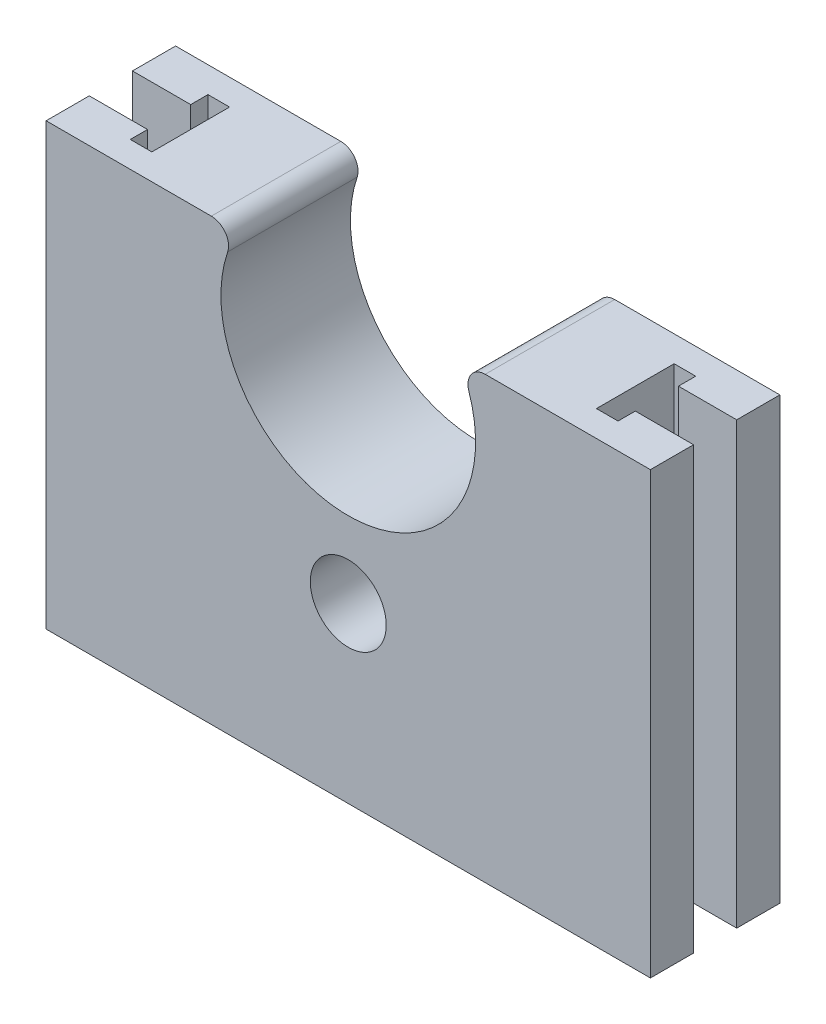
ISO-10303-21;
HEADER;
FILE_DESCRIPTION(('STEP AP214'),'2;1');
FILE_NAME('part.step','',(''),(''),'','','');
FILE_SCHEMA(('AUTOMOTIVE_DESIGN { 1 0 10303 214 1 1 1 1 }'));
ENDSEC;
DATA;
#1=APPLICATION_CONTEXT('core data for automotive mechanical design processes');
#2=APPLICATION_PROTOCOL_DEFINITION('international standard','automotive_design',2000,#1);
#3=PRODUCT_CONTEXT('',#1,'mechanical');
#4=PRODUCT('Part','Part','',(#3));
#5=PRODUCT_RELATED_PRODUCT_CATEGORY('part','',(#4));
#6=PRODUCT_DEFINITION_FORMATION('','',#4);
#7=PRODUCT_DEFINITION_CONTEXT('part definition',#1,'design');
#8=PRODUCT_DEFINITION('design','',#6,#7);
#9=PRODUCT_DEFINITION_SHAPE('','',#8);
#10=(LENGTH_UNIT() NAMED_UNIT(*) SI_UNIT(.MILLI.,.METRE.));
#11=(NAMED_UNIT(*) PLANE_ANGLE_UNIT() SI_UNIT($,.RADIAN.));
#12=(NAMED_UNIT(*) SI_UNIT($,.STERADIAN.) SOLID_ANGLE_UNIT());
#13=UNCERTAINTY_MEASURE_WITH_UNIT(LENGTH_MEASURE(1.E-05),#10,'distance_accuracy_value','');
#14=(GEOMETRIC_REPRESENTATION_CONTEXT(3) GLOBAL_UNCERTAINTY_ASSIGNED_CONTEXT((#13)) GLOBAL_UNIT_ASSIGNED_CONTEXT((#10,
#11,#12)) REPRESENTATION_CONTEXT('',''));
#15=CARTESIAN_POINT('',(0.,0.,0.));
#16=DIRECTION('',(0.,0.,1.));
#17=DIRECTION('',(1.,0.,0.));
#18=AXIS2_PLACEMENT_3D('',#15,#16,#17);
#19=CARTESIAN_POINT('',(42.4004975124378,28.0149253731343,15.));
#20=DIRECTION('',(-1.,0.,0.));
#21=DIRECTION('',(0.,0.,1.));
#22=AXIS2_PLACEMENT_3D('',#19,#20,#21);
#23=PLANE('',#22);
#24=DIRECTION('',(0.,1.,0.));
#25=VECTOR('',#24,1.);
#26=CARTESIAN_POINT('',(42.4004975124378,-22.9850746268657,10.));
#27=LINE('',#26,#25);
#28=CARTESIAN_POINT('',(42.4004975124378,-22.9850746268657,10.));
#29=VERTEX_POINT('',#28);
#30=CARTESIAN_POINT('',(42.4004975124378,28.0149253731343,10.));
#31=VERTEX_POINT('',#30);
#32=EDGE_CURVE('E241',#29,#31,#27,.T.);
#33=ORIENTED_EDGE('',*,*,#32,.T.);
#34=DIRECTION('',(0.,0.,-1.));
#35=VECTOR('',#34,1.);
#36=CARTESIAN_POINT('',(42.4004975124378,28.0149253731343,15.));
#37=LINE('',#36,#35);
#38=CARTESIAN_POINT('',(42.4004975124378,28.0149253731343,15.));
#39=VERTEX_POINT('',#38);
#40=EDGE_CURVE('E451',#39,#31,#37,.T.);
#41=ORIENTED_EDGE('',*,*,#40,.F.);
#42=DIRECTION('',(0.,1.,0.));
#43=VECTOR('',#42,1.);
#44=CARTESIAN_POINT('',(42.4004975124378,28.0149253731343,15.));
#45=LINE('',#44,#43);
#46=CARTESIAN_POINT('',(42.4004975124378,-22.9850746268657,15.));
#47=VERTEX_POINT('',#46);
#48=EDGE_CURVE('E368',#47,#39,#45,.T.);
#49=ORIENTED_EDGE('',*,*,#48,.F.);
#50=DIRECTION('',(0.,0.,-1.));
#51=VECTOR('',#50,1.);
#52=CARTESIAN_POINT('',(42.4004975124378,-22.9850746268657,15.));
#53=LINE('',#52,#51);
#54=EDGE_CURVE('E421',#47,#29,#53,.T.);
#55=ORIENTED_EDGE('',*,*,#54,.T.);
#56=EDGE_LOOP('',(#33,#41,#49,#55));
#57=FACE_BOUND('',#56,.T.);
#58=ADVANCED_FACE('F67',(#57),#23,.F.);
#59=CARTESIAN_POINT('',(42.4004975124378,28.0149253731343,15.));
#60=DIRECTION('',(0.,-1.,0.));
#61=DIRECTION('',(0.,0.,-1.));
#62=AXIS2_PLACEMENT_3D('',#59,#60,#61);
#63=PLANE('',#62);
#64=DIRECTION('',(-1.,0.,0.));
#65=VECTOR('',#64,1.);
#66=CARTESIAN_POINT('',(0.,28.0149253731343,10.));
#67=LINE('',#66,#65);
#68=CARTESIAN_POINT('',(35.6504975124378,28.0149253731343,10.));
#69=VERTEX_POINT('',#68);
#70=EDGE_CURVE('E294',#31,#69,#67,.T.);
#71=ORIENTED_EDGE('',*,*,#70,.T.);
#72=DIRECTION('',(0.,0.,-1.));
#73=VECTOR('',#72,1.);
#74=CARTESIAN_POINT('',(35.6504975124378,28.0149253731343,12.));
#75=LINE('',#74,#73);
#76=CARTESIAN_POINT('',(35.6504975124378,28.0149253731343,12.));
#77=VERTEX_POINT('',#76);
#78=EDGE_CURVE('E237',#77,#69,#75,.T.);
#79=ORIENTED_EDGE('',*,*,#78,.F.);
#80=DIRECTION('',(-1.,0.,0.));
#81=VECTOR('',#80,1.);
#82=CARTESIAN_POINT('',(35.6504975124378,28.0149253731343,12.));
#83=LINE('',#82,#81);
#84=CARTESIAN_POINT('',(33.1504975124378,28.0149253731343,12.));
#85=VERTEX_POINT('',#84);
#86=EDGE_CURVE('E269',#77,#85,#83,.T.);
#87=ORIENTED_EDGE('',*,*,#86,.T.);
#88=DIRECTION('',(0.,0.,-1.));
#89=VECTOR('',#88,1.);
#90=CARTESIAN_POINT('',(33.1504975124378,28.0149253731343,12.));
#91=LINE('',#90,#89);
#92=CARTESIAN_POINT('',(33.1504975124378,28.0149253731343,2.99999999999998));
#93=VERTEX_POINT('',#92);
#94=EDGE_CURVE('E273',#85,#93,#91,.T.);
#95=ORIENTED_EDGE('',*,*,#94,.T.);
#96=DIRECTION('',(-1.,0.,0.));
#97=VECTOR('',#96,1.);
#98=CARTESIAN_POINT('',(35.6504975124378,28.0149253731343,2.99999999999998));
#99=LINE('',#98,#97);
#100=CARTESIAN_POINT('',(35.6504975124378,28.0149253731343,2.99999999999998));
#101=VERTEX_POINT('',#100);
#102=EDGE_CURVE('E278',#101,#93,#99,.T.);
#103=ORIENTED_EDGE('',*,*,#102,.F.);
#104=CARTESIAN_POINT('',(35.6504975124378,28.0149253731343,5.));
#105=VERTEX_POINT('',#104);
#106=EDGE_CURVE('E282',#105,#101,#75,.T.);
#107=ORIENTED_EDGE('',*,*,#106,.F.);
#108=DIRECTION('',(-1.,0.,0.));
#109=VECTOR('',#108,1.);
#110=CARTESIAN_POINT('',(0.,28.0149253731343,5.));
#111=LINE('',#110,#109);
#112=CARTESIAN_POINT('',(42.4004975124378,28.0149253731343,5.));
#113=VERTEX_POINT('',#112);
#114=EDGE_CURVE('E252',#113,#105,#111,.T.);
#115=ORIENTED_EDGE('',*,*,#114,.F.);
#116=CARTESIAN_POINT('',(42.4004975124378,28.0149253731343,0.));
#117=VERTEX_POINT('',#116);
#118=EDGE_CURVE('E450',#113,#117,#37,.T.);
#119=ORIENTED_EDGE('',*,*,#118,.T.);
#120=DIRECTION('',(-1.,0.,0.));
#121=VECTOR('',#120,1.);
#122=CARTESIAN_POINT('',(42.4004975124378,28.0149253731343,0.));
#123=LINE('',#122,#121);
#124=CARTESIAN_POINT('',(23.2646670463277,28.0149253731343,0.));
#125=VERTEX_POINT('',#124);
#126=EDGE_CURVE('E398',#117,#125,#123,.T.);
#127=ORIENTED_EDGE('',*,*,#126,.T.);
#128=DIRECTION('',(0.,0.,-1.));
#129=VECTOR('',#128,1.);
#130=CARTESIAN_POINT('',(23.2646670463277,28.0149253731343,15.));
#131=LINE('',#130,#129);
#132=CARTESIAN_POINT('',(23.2646670463277,28.0149253731343,15.));
#133=VERTEX_POINT('',#132);
#134=EDGE_CURVE('E446',#133,#125,#131,.T.);
#135=ORIENTED_EDGE('',*,*,#134,.F.);
#136=DIRECTION('',(-1.,0.,0.));
#137=VECTOR('',#136,1.);
#138=CARTESIAN_POINT('',(42.4004975124378,28.0149253731343,15.));
#139=LINE('',#138,#137);
#140=EDGE_CURVE('E372',#39,#133,#139,.T.);
#141=ORIENTED_EDGE('',*,*,#140,.F.);
#142=ORIENTED_EDGE('',*,*,#40,.T.);
#143=EDGE_LOOP('',(#71,#79,#87,#95,#103,#107,#115,#119,#127,#135,#141,#142));
#144=FACE_BOUND('',#143,.T.);
#145=ADVANCED_FACE('F509',(#144),#63,.F.);
#146=CARTESIAN_POINT('',(-8.46367202145209,28.0149253731343,15.));
#147=DIRECTION('',(0.,-1.,0.));
#148=DIRECTION('',(1.,0.,0.));
#149=AXIS2_PLACEMENT_3D('',#146,#147,#148);
#150=PLANE('',#149);
#151=DIRECTION('',(1.,0.,0.));
#152=VECTOR('',#151,1.);
#153=CARTESIAN_POINT('',(0.,28.0149253731343,5.));
#154=LINE('',#153,#152);
#155=CARTESIAN_POINT('',(-27.5995024875622,28.0149253731343,5.));
#156=VERTEX_POINT('',#155);
#157=CARTESIAN_POINT('',(-20.8495024875622,28.0149253731343,5.));
#158=VERTEX_POINT('',#157);
#159=EDGE_CURVE('E342',#156,#158,#154,.T.);
#160=ORIENTED_EDGE('',*,*,#159,.T.);
#161=DIRECTION('',(0.,0.,-1.));
#162=VECTOR('',#161,1.);
#163=CARTESIAN_POINT('',(-20.8495024875622,28.0149253731343,11.9999586403807));
#164=LINE('',#163,#162);
#165=CARTESIAN_POINT('',(-20.8495024875622,28.0149253731343,2.99995864038069));
#166=VERTEX_POINT('',#165);
#167=EDGE_CURVE('E313',#158,#166,#164,.T.);
#168=ORIENTED_EDGE('',*,*,#167,.T.);
#169=DIRECTION('',(1.,0.,0.));
#170=VECTOR('',#169,1.);
#171=CARTESIAN_POINT('',(-20.8495024875622,28.0149253731343,2.99995864038069));
#172=LINE('',#171,#170);
#173=CARTESIAN_POINT('',(-18.3495024875622,28.0149253731343,2.99995864038069));
#174=VERTEX_POINT('',#173);
#175=EDGE_CURVE('E314',#166,#174,#172,.T.);
#176=ORIENTED_EDGE('',*,*,#175,.T.);
#177=DIRECTION('',(0.,0.,-1.));
#178=VECTOR('',#177,1.);
#179=CARTESIAN_POINT('',(-18.3495024875622,28.0149253731343,11.9999586403807));
#180=LINE('',#179,#178);
#181=CARTESIAN_POINT('',(-18.3495024875622,28.0149253731343,11.9999586403807));
#182=VERTEX_POINT('',#181);
#183=EDGE_CURVE('E318',#182,#174,#180,.T.);
#184=ORIENTED_EDGE('',*,*,#183,.F.);
#185=DIRECTION('',(1.,0.,0.));
#186=VECTOR('',#185,1.);
#187=CARTESIAN_POINT('',(-20.8495024875622,28.0149253731343,11.9999586403807));
#188=LINE('',#187,#186);
#189=CARTESIAN_POINT('',(-20.8495024875622,28.0149253731343,11.9999586403807));
#190=VERTEX_POINT('',#189);
#191=EDGE_CURVE('E274',#190,#182,#188,.T.);
#192=ORIENTED_EDGE('',*,*,#191,.F.);
#193=CARTESIAN_POINT('',(-20.8495024875622,28.0149253731343,10.));
#194=VERTEX_POINT('',#193);
#195=EDGE_CURVE('E309',#190,#194,#164,.T.);
#196=ORIENTED_EDGE('',*,*,#195,.T.);
#197=DIRECTION('',(1.,0.,0.));
#198=VECTOR('',#197,1.);
#199=CARTESIAN_POINT('',(0.,28.0149253731343,10.));
#200=LINE('',#199,#198);
#201=CARTESIAN_POINT('',(-27.5995024875622,28.0149253731343,10.));
#202=VERTEX_POINT('',#201);
#203=EDGE_CURVE('E308',#202,#194,#200,.T.);
#204=ORIENTED_EDGE('',*,*,#203,.F.);
#205=DIRECTION('',(0.,0.,-1.));
#206=VECTOR('',#205,1.);
#207=CARTESIAN_POINT('',(-27.5995024875622,28.0149253731343,15.));
#208=LINE('',#207,#206);
#209=CARTESIAN_POINT('',(-27.5995024875622,28.0149253731343,15.));
#210=VERTEX_POINT('',#209);
#211=EDGE_CURVE('E430',#210,#202,#208,.T.);
#212=ORIENTED_EDGE('',*,*,#211,.F.);
#213=DIRECTION('',(-1.,0.,0.));
#214=VECTOR('',#213,1.);
#215=CARTESIAN_POINT('',(-8.46367202145209,28.0149253731343,15.));
#216=LINE('',#215,#214);
#217=CARTESIAN_POINT('',(-8.46367202145209,28.0149253731343,15.));
#218=VERTEX_POINT('',#217);
#219=EDGE_CURVE('E385',#218,#210,#216,.T.);
#220=ORIENTED_EDGE('',*,*,#219,.F.);
#221=DIRECTION('',(0.,0.,-1.));
#222=VECTOR('',#221,1.);
#223=CARTESIAN_POINT('',(-8.46367202145209,28.0149253731343,15.));
#224=LINE('',#223,#222);
#225=CARTESIAN_POINT('',(-8.46367202145209,28.0149253731343,0.));
#226=VERTEX_POINT('',#225);
#227=EDGE_CURVE('E434',#218,#226,#224,.T.);
#228=ORIENTED_EDGE('',*,*,#227,.T.);
#229=DIRECTION('',(-1.,0.,0.));
#230=VECTOR('',#229,1.);
#231=CARTESIAN_POINT('',(-8.46367202145209,28.0149253731343,0.));
#232=LINE('',#231,#230);
#233=CARTESIAN_POINT('',(-27.5995024875622,28.0149253731343,0.));
#234=VERTEX_POINT('',#233);
#235=EDGE_CURVE('E410',#226,#234,#232,.T.);
#236=ORIENTED_EDGE('',*,*,#235,.T.);
#237=EDGE_CURVE('E429',#156,#234,#208,.T.);
#238=ORIENTED_EDGE('',*,*,#237,.F.);
#239=EDGE_LOOP('',(#160,#168,#176,#184,#192,#196,#204,#212,#220,#228,#236,#238));
#240=FACE_BOUND('',#239,.T.);
#241=ADVANCED_FACE('F468',(#240),#150,.F.);
#242=CARTESIAN_POINT('',(-27.5995024875622,28.0149253731343,15.));
#243=DIRECTION('',(1.,0.,0.));
#244=DIRECTION('',(0.,0.,-1.));
#245=AXIS2_PLACEMENT_3D('',#242,#243,#244);
#246=PLANE('',#245);
#247=DIRECTION('',(0.,-1.,0.));
#248=VECTOR('',#247,1.);
#249=CARTESIAN_POINT('',(-27.5995024875622,28.0149253731343,5.));
#250=LINE('',#249,#248);
#251=CARTESIAN_POINT('',(-27.5995024875622,-22.9850746268657,5.));
#252=VERTEX_POINT('',#251);
#253=EDGE_CURVE('E351',#156,#252,#250,.T.);
#254=ORIENTED_EDGE('',*,*,#253,.F.);
#255=ORIENTED_EDGE('',*,*,#237,.T.);
#256=DIRECTION('',(0.,-1.,0.));
#257=VECTOR('',#256,1.);
#258=CARTESIAN_POINT('',(-27.5995024875622,28.0149253731343,0.));
#259=LINE('',#258,#257);
#260=CARTESIAN_POINT('',(-27.5995024875622,-22.9850746268657,0.));
#261=VERTEX_POINT('',#260);
#262=EDGE_CURVE('E414',#234,#261,#259,.T.);
#263=ORIENTED_EDGE('',*,*,#262,.T.);
#264=DIRECTION('',(0.,0.,-1.));
#265=VECTOR('',#264,1.);
#266=CARTESIAN_POINT('',(-27.5995024875622,-22.9850746268657,15.));
#267=LINE('',#266,#265);
#268=EDGE_CURVE('E424',#252,#261,#267,.T.);
#269=ORIENTED_EDGE('',*,*,#268,.F.);
#270=EDGE_LOOP('',(#254,#255,#263,#269));
#271=FACE_BOUND('',#270,.T.);
#272=ADVANCED_FACE('F552',(#271),#246,.F.);
#273=CARTESIAN_POINT('',(42.4004975124378,-22.9850746268657,15.));
#274=DIRECTION('',(0.,1.,0.));
#275=DIRECTION('',(0.,0.,1.));
#276=AXIS2_PLACEMENT_3D('',#273,#274,#275);
#277=PLANE('',#276);
#278=DIRECTION('',(-1.,0.,0.));
#279=VECTOR('',#278,1.);
#280=CARTESIAN_POINT('',(0.,-22.9850746268657,10.));
#281=LINE('',#280,#279);
#282=CARTESIAN_POINT('',(35.6504975124378,-22.9850746268657,10.));
#283=VERTEX_POINT('',#282);
#284=EDGE_CURVE('E245',#29,#283,#281,.T.);
#285=ORIENTED_EDGE('',*,*,#284,.F.);
#286=ORIENTED_EDGE('',*,*,#54,.F.);
#287=DIRECTION('',(1.,0.,0.));
#288=VECTOR('',#287,1.);
#289=CARTESIAN_POINT('',(42.4004975124378,-22.9850746268657,15.));
#290=LINE('',#289,#288);
#291=CARTESIAN_POINT('',(-27.5995024875622,-22.9850746268657,15.));
#292=VERTEX_POINT('',#291);
#293=EDGE_CURVE('E391',#292,#47,#290,.T.);
#294=ORIENTED_EDGE('',*,*,#293,.F.);
#295=CARTESIAN_POINT('',(-27.5995024875622,-22.9850746268657,10.));
#296=VERTEX_POINT('',#295);
#297=EDGE_CURVE('E425',#292,#296,#267,.T.);
#298=ORIENTED_EDGE('',*,*,#297,.T.);
#299=DIRECTION('',(1.,0.,0.));
#300=VECTOR('',#299,1.);
#301=CARTESIAN_POINT('',(42.4004975124378,-22.9850746268657,10.));
#302=LINE('',#301,#300);
#303=CARTESIAN_POINT('',(-20.8495024875622,-22.9850746268657,10.));
#304=VERTEX_POINT('',#303);
#305=EDGE_CURVE('E76',#296,#304,#302,.T.);
#306=ORIENTED_EDGE('',*,*,#305,.T.);
#307=DIRECTION('',(0.,0.,-1.));
#308=VECTOR('',#307,1.);
#309=CARTESIAN_POINT('',(-20.8495024875622,-22.9850746268657,11.9999586403807));
#310=LINE('',#309,#308);
#311=CARTESIAN_POINT('',(-20.8495024875622,-22.9850746268657,11.9999586403807));
#312=VERTEX_POINT('',#311);
#313=EDGE_CURVE('E298',#312,#304,#310,.T.);
#314=ORIENTED_EDGE('',*,*,#313,.F.);
#315=DIRECTION('',(1.,0.,0.));
#316=VECTOR('',#315,1.);
#317=CARTESIAN_POINT('',(-20.8495024875622,-22.9850746268657,11.9999586403807));
#318=LINE('',#317,#316);
#319=CARTESIAN_POINT('',(-18.3495024875622,-22.9850746268657,11.9999586403807));
#320=VERTEX_POINT('',#319);
#321=EDGE_CURVE('E91',#312,#320,#318,.T.);
#322=ORIENTED_EDGE('',*,*,#321,.T.);
#323=DIRECTION('',(0.,0.,-1.));
#324=VECTOR('',#323,1.);
#325=CARTESIAN_POINT('',(-18.3495024875622,-22.9850746268657,11.9999586403807));
#326=LINE('',#325,#324);
#327=CARTESIAN_POINT('',(-18.3495024875622,-22.9850746268657,2.99995864038069));
#328=VERTEX_POINT('',#327);
#329=EDGE_CURVE('E332',#320,#328,#326,.T.);
#330=ORIENTED_EDGE('',*,*,#329,.T.);
#331=DIRECTION('',(1.,0.,0.));
#332=VECTOR('',#331,1.);
#333=CARTESIAN_POINT('',(-20.8495024875622,-22.9850746268657,2.99995864038069));
#334=LINE('',#333,#332);
#335=CARTESIAN_POINT('',(-20.8495024875622,-22.9850746268657,2.99995864038069));
#336=VERTEX_POINT('',#335);
#337=EDGE_CURVE('E329',#336,#328,#334,.T.);
#338=ORIENTED_EDGE('',*,*,#337,.F.);
#339=CARTESIAN_POINT('',(-20.8495024875622,-22.9850746268657,5.));
#340=VERTEX_POINT('',#339);
#341=EDGE_CURVE('E328',#340,#336,#310,.T.);
#342=ORIENTED_EDGE('',*,*,#341,.F.);
#343=DIRECTION('',(1.,0.,0.));
#344=VECTOR('',#343,1.);
#345=CARTESIAN_POINT('',(42.4004975124378,-22.9850746268657,5.00000000000001));
#346=LINE('',#345,#344);
#347=EDGE_CURVE('E12',#252,#340,#346,.T.);
#348=ORIENTED_EDGE('',*,*,#347,.F.);
#349=ORIENTED_EDGE('',*,*,#268,.T.);
#350=DIRECTION('',(1.,0.,0.));
#351=VECTOR('',#350,1.);
#352=CARTESIAN_POINT('',(42.4004975124378,-22.9850746268657,0.));
#353=LINE('',#352,#351);
#354=CARTESIAN_POINT('',(42.4004975124378,-22.9850746268657,0.));
#355=VERTEX_POINT('',#354);
#356=EDGE_CURVE('E373',#261,#355,#353,.T.);
#357=ORIENTED_EDGE('',*,*,#356,.T.);
#358=CARTESIAN_POINT('',(42.4004975124378,-22.9850746268657,5.));
#359=VERTEX_POINT('',#358);
#360=EDGE_CURVE('E394',#359,#355,#53,.T.);
#361=ORIENTED_EDGE('',*,*,#360,.F.);
#362=DIRECTION('',(-1.,0.,0.));
#363=VECTOR('',#362,1.);
#364=CARTESIAN_POINT('',(0.,-22.9850746268657,5.));
#365=LINE('',#364,#363);
#366=CARTESIAN_POINT('',(35.6504975124378,-22.9850746268657,5.));
#367=VERTEX_POINT('',#366);
#368=EDGE_CURVE('E242',#359,#367,#365,.T.);
#369=ORIENTED_EDGE('',*,*,#368,.T.);
#370=DIRECTION('',(0.,0.,-1.));
#371=VECTOR('',#370,1.);
#372=CARTESIAN_POINT('',(35.6504975124378,-22.9850746268657,12.));
#373=LINE('',#372,#371);
#374=CARTESIAN_POINT('',(35.6504975124378,-22.9850746268657,2.99999999999998));
#375=VERTEX_POINT('',#374);
#376=EDGE_CURVE('E259',#367,#375,#373,.T.);
#377=ORIENTED_EDGE('',*,*,#376,.T.);
#378=DIRECTION('',(-1.,0.,0.));
#379=VECTOR('',#378,1.);
#380=CARTESIAN_POINT('',(35.6504975124378,-22.9850746268657,2.99999999999998));
#381=LINE('',#380,#379);
#382=CARTESIAN_POINT('',(33.1504975124378,-22.9850746268657,2.99999999999998));
#383=VERTEX_POINT('',#382);
#384=EDGE_CURVE('E83',#375,#383,#381,.T.);
#385=ORIENTED_EDGE('',*,*,#384,.T.);
#386=DIRECTION('',(0.,0.,-1.));
#387=VECTOR('',#386,1.);
#388=CARTESIAN_POINT('',(33.1504975124378,-22.9850746268657,12.));
#389=LINE('',#388,#387);
#390=CARTESIAN_POINT('',(33.1504975124378,-22.9850746268657,12.));
#391=VERTEX_POINT('',#390);
#392=EDGE_CURVE('E496',#391,#383,#389,.T.);
#393=ORIENTED_EDGE('',*,*,#392,.F.);
#394=DIRECTION('',(-1.,0.,0.));
#395=VECTOR('',#394,1.);
#396=CARTESIAN_POINT('',(35.6504975124378,-22.9850746268657,12.));
#397=LINE('',#396,#395);
#398=CARTESIAN_POINT('',(35.6504975124378,-22.9850746268657,12.));
#399=VERTEX_POINT('',#398);
#400=EDGE_CURVE('E256',#399,#391,#397,.T.);
#401=ORIENTED_EDGE('',*,*,#400,.F.);
#402=EDGE_CURVE('E234',#399,#283,#373,.T.);
#403=ORIENTED_EDGE('',*,*,#402,.T.);
#404=EDGE_LOOP('',(#285,#286,#294,#298,#306,#314,#322,#330,#338,#342,#348,#349,#357,#361,#369,
#377,#385,#393,#401,#403));
#405=FACE_BOUND('',#404,.T.);
#406=ADVANCED_FACE('F254',(#405),#277,.F.);
#407=ORIENTED_EDGE('',*,*,#118,.F.);
#408=DIRECTION('',(0.,1.,0.));
#409=VECTOR('',#408,1.);
#410=CARTESIAN_POINT('',(42.4004975124378,-22.9850746268657,5.));
#411=LINE('',#410,#409);
#412=EDGE_CURVE('E526',#359,#113,#411,.T.);
#413=ORIENTED_EDGE('',*,*,#412,.F.);
#414=ORIENTED_EDGE('',*,*,#360,.T.);
#415=DIRECTION('',(0.,1.,0.));
#416=VECTOR('',#415,1.);
#417=CARTESIAN_POINT('',(42.4004975124378,28.0149253731343,0.));
#418=LINE('',#417,#416);
#419=EDGE_CURVE('E364',#355,#117,#418,.T.);
#420=ORIENTED_EDGE('',*,*,#419,.T.);
#421=EDGE_LOOP('',(#407,#413,#414,#420));
#422=FACE_BOUND('',#421,.T.);
#423=ADVANCED_FACE('F69',(#422),#23,.F.);
#424=CARTESIAN_POINT('',(23.2646670463277,26.0149253731343,15.));
#425=DIRECTION('',(0.,0.,-1.));
#426=DIRECTION('',(-1.,0.,0.));
#427=AXIS2_PLACEMENT_3D('',#424,#425,#426);
#428=CYLINDRICAL_SURFACE('',#427,2.);
#429=CARTESIAN_POINT('',(23.2646670463277,26.0149253731343,0.));
#430=DIRECTION('',(0.,0.,1.));
#431=DIRECTION('',(1.,0.,0.));
#432=AXIS2_PLACEMENT_3D('',#429,#430,#431);
#433=CIRCLE('',#432,2.);
#434=CARTESIAN_POINT('',(21.3704378482513,25.3731343283582,0.));
#435=VERTEX_POINT('',#434);
#436=EDGE_CURVE('E401',#125,#435,#433,.T.);
#437=ORIENTED_EDGE('',*,*,#436,.T.);
#438=DIRECTION('',(0.,0.,-1.));
#439=VECTOR('',#438,1.);
#440=CARTESIAN_POINT('',(21.3704378482513,25.3731343283582,15.));
#441=LINE('',#440,#439);
#442=CARTESIAN_POINT('',(21.3704378482513,25.3731343283582,15.));
#443=VERTEX_POINT('',#442);
#444=EDGE_CURVE('E442',#443,#435,#441,.T.);
#445=ORIENTED_EDGE('',*,*,#444,.F.);
#446=CARTESIAN_POINT('',(23.2646670463277,26.0149253731343,15.));
#447=DIRECTION('',(0.,0.,1.));
#448=DIRECTION('',(1.,0.,0.));
#449=AXIS2_PLACEMENT_3D('',#446,#447,#448);
#450=CIRCLE('',#449,2.);
#451=EDGE_CURVE('E376',#133,#443,#450,.T.);
#452=ORIENTED_EDGE('',*,*,#451,.F.);
#453=ORIENTED_EDGE('',*,*,#134,.T.);
#454=EDGE_LOOP('',(#437,#445,#452,#453));
#455=FACE_BOUND('',#454,.T.);
#456=ADVANCED_FACE('F564',(#455),#428,.T.);
#457=CARTESIAN_POINT('',(7.40049751243779,20.6399253731343,15.));
#458=DIRECTION('',(0.,0.,-1.));
#459=DIRECTION('',(-1.,0.,0.));
#460=AXIS2_PLACEMENT_3D('',#457,#458,#459);
#461=CYLINDRICAL_SURFACE('',#460,14.75);
#462=CARTESIAN_POINT('',(7.40049751243779,20.6399253731343,0.));
#463=DIRECTION('',(0.,0.,-1.));
#464=DIRECTION('',(1.,0.,0.));
#465=AXIS2_PLACEMENT_3D('',#462,#463,#464);
#466=CIRCLE('',#465,14.75);
#467=CARTESIAN_POINT('',(-6.56944282337568,25.3731343283582,0.));
#468=VERTEX_POINT('',#467);
#469=EDGE_CURVE('E404',#435,#468,#466,.T.);
#470=ORIENTED_EDGE('',*,*,#469,.T.);
#471=DIRECTION('',(0.,0.,-1.));
#472=VECTOR('',#471,1.);
#473=CARTESIAN_POINT('',(-6.56944282337568,25.3731343283582,15.));
#474=LINE('',#473,#472);
#475=CARTESIAN_POINT('',(-6.56944282337568,25.3731343283582,15.));
#476=VERTEX_POINT('',#475);
#477=EDGE_CURVE('E438',#476,#468,#474,.T.);
#478=ORIENTED_EDGE('',*,*,#477,.F.);
#479=CARTESIAN_POINT('',(7.40049751243779,20.6399253731343,15.));
#480=DIRECTION('',(0.,0.,-1.));
#481=DIRECTION('',(1.,0.,0.));
#482=AXIS2_PLACEMENT_3D('',#479,#480,#481);
#483=CIRCLE('',#482,14.75);
#484=EDGE_CURVE('E379',#443,#476,#483,.T.);
#485=ORIENTED_EDGE('',*,*,#484,.F.);
#486=ORIENTED_EDGE('',*,*,#444,.T.);
#487=EDGE_LOOP('',(#470,#478,#485,#486));
#488=FACE_BOUND('',#487,.T.);
#489=ADVANCED_FACE('F567',(#488),#461,.F.);
#490=CARTESIAN_POINT('',(-8.46367202145209,26.0149253731343,15.));
#491=DIRECTION('',(0.,0.,-1.));
#492=DIRECTION('',(-1.,0.,0.));
#493=AXIS2_PLACEMENT_3D('',#490,#491,#492);
#494=CYLINDRICAL_SURFACE('',#493,2.);
#495=CARTESIAN_POINT('',(-8.46367202145209,26.0149253731343,0.));
#496=DIRECTION('',(0.,0.,1.));
#497=DIRECTION('',(-1.,0.,0.));
#498=AXIS2_PLACEMENT_3D('',#495,#496,#497);
#499=CIRCLE('',#498,2.);
#500=EDGE_CURVE('E407',#468,#226,#499,.T.);
#501=ORIENTED_EDGE('',*,*,#500,.T.);
#502=ORIENTED_EDGE('',*,*,#227,.F.);
#503=CARTESIAN_POINT('',(-8.46367202145209,26.0149253731343,15.));
#504=DIRECTION('',(0.,0.,1.));
#505=DIRECTION('',(-1.,0.,0.));
#506=AXIS2_PLACEMENT_3D('',#503,#504,#505);
#507=CIRCLE('',#506,2.);
#508=EDGE_CURVE('E382',#476,#218,#507,.T.);
#509=ORIENTED_EDGE('',*,*,#508,.F.);
#510=ORIENTED_EDGE('',*,*,#477,.T.);
#511=EDGE_LOOP('',(#501,#502,#509,#510));
#512=FACE_BOUND('',#511,.T.);
#513=ADVANCED_FACE('F539',(#512),#494,.T.);
#514=ORIENTED_EDGE('',*,*,#211,.T.);
#515=DIRECTION('',(0.,-1.,0.));
#516=VECTOR('',#515,1.);
#517=CARTESIAN_POINT('',(-27.5995024875622,28.0149253731343,10.));
#518=LINE('',#517,#516);
#519=EDGE_CURVE('E354',#202,#296,#518,.T.);
#520=ORIENTED_EDGE('',*,*,#519,.T.);
#521=ORIENTED_EDGE('',*,*,#297,.F.);
#522=DIRECTION('',(0.,-1.,0.));
#523=VECTOR('',#522,1.);
#524=CARTESIAN_POINT('',(-27.5995024875622,28.0149253731343,15.));
#525=LINE('',#524,#523);
#526=EDGE_CURVE('E388',#210,#292,#525,.T.);
#527=ORIENTED_EDGE('',*,*,#526,.F.);
#528=EDGE_LOOP('',(#514,#520,#521,#527));
#529=FACE_BOUND('',#528,.T.);
#530=ADVANCED_FACE('F463',(#529),#246,.F.);
#531=CARTESIAN_POINT('',(-8.46367202145209,26.0149253731343,15.));
#532=DIRECTION('',(0.,0.,-1.));
#533=DIRECTION('',(-1.,0.,0.));
#534=AXIS2_PLACEMENT_3D('',#531,#532,#533);
#535=PLANE('',#534);
#536=CARTESIAN_POINT('',(7.4004975124378,-2.91007462686567,15.));
#537=DIRECTION('',(0.,0.,1.));
#538=DIRECTION('',(1.,0.,0.));
#539=AXIS2_PLACEMENT_3D('',#536,#537,#538);
#540=CIRCLE('',#539,4.4);
#541=CARTESIAN_POINT('',(11.8004975124378,-2.91007462686567,15.));
#542=VERTEX_POINT('',#541);
#543=EDGE_CURVE('E359',#542,#542,#540,.T.);
#544=ORIENTED_EDGE('',*,*,#543,.F.);
#545=EDGE_LOOP('',(#544));
#546=FACE_BOUND('',#545,.T.);
#547=ORIENTED_EDGE('',*,*,#48,.T.);
#548=ORIENTED_EDGE('',*,*,#140,.T.);
#549=ORIENTED_EDGE('',*,*,#451,.T.);
#550=ORIENTED_EDGE('',*,*,#484,.T.);
#551=ORIENTED_EDGE('',*,*,#508,.T.);
#552=ORIENTED_EDGE('',*,*,#219,.T.);
#553=ORIENTED_EDGE('',*,*,#526,.T.);
#554=ORIENTED_EDGE('',*,*,#293,.T.);
#555=EDGE_LOOP('',(#547,#548,#549,#550,#551,#552,#553,#554));
#556=FACE_BOUND('',#555,.T.);
#557=ADVANCED_FACE('F533',(#546,#556),#535,.F.);
#558=CARTESIAN_POINT('',(-8.46367202145209,26.0149253731343,0.));
#559=DIRECTION('',(0.,0.,-1.));
#560=DIRECTION('',(-1.,0.,0.));
#561=AXIS2_PLACEMENT_3D('',#558,#559,#560);
#562=PLANE('',#561);
#563=CARTESIAN_POINT('',(7.4004975124378,-2.91007462686567,0.));
#564=DIRECTION('',(0.,0.,1.));
#565=DIRECTION('',(1.,0.,0.));
#566=AXIS2_PLACEMENT_3D('',#563,#564,#565);
#567=CIRCLE('',#566,4.4);
#568=CARTESIAN_POINT('',(11.8004975124378,-2.91007462686567,0.));
#569=VERTEX_POINT('',#568);
#570=EDGE_CURVE('E360',#569,#569,#567,.T.);
#571=ORIENTED_EDGE('',*,*,#570,.T.);
#572=EDGE_LOOP('',(#571));
#573=FACE_BOUND('',#572,.T.);
#574=ORIENTED_EDGE('',*,*,#419,.F.);
#575=ORIENTED_EDGE('',*,*,#356,.F.);
#576=ORIENTED_EDGE('',*,*,#262,.F.);
#577=ORIENTED_EDGE('',*,*,#235,.F.);
#578=ORIENTED_EDGE('',*,*,#500,.F.);
#579=ORIENTED_EDGE('',*,*,#469,.F.);
#580=ORIENTED_EDGE('',*,*,#436,.F.);
#581=ORIENTED_EDGE('',*,*,#126,.F.);
#582=EDGE_LOOP('',(#574,#575,#576,#577,#578,#579,#580,#581));
#583=FACE_BOUND('',#582,.T.);
#584=ADVANCED_FACE('F546',(#573,#583),#562,.T.);
#585=CARTESIAN_POINT('',(7.4004975124378,-2.91007462686567,0.));
#586=DIRECTION('',(0.,0.,1.));
#587=DIRECTION('',(1.,0.,0.));
#588=AXIS2_PLACEMENT_3D('',#585,#586,#587);
#589=CYLINDRICAL_SURFACE('',#588,4.4);
#590=ORIENTED_EDGE('',*,*,#570,.F.);
#591=EDGE_LOOP('',(#590));
#592=FACE_BOUND('',#591,.T.);
#593=ORIENTED_EDGE('',*,*,#543,.T.);
#594=EDGE_LOOP('',(#593));
#595=FACE_BOUND('',#594,.T.);
#596=ADVANCED_FACE('F634',(#592,#595),#589,.F.);
#597=CARTESIAN_POINT('',(0.,-22.9850746268657,10.));
#598=DIRECTION('',(0.,0.,1.));
#599=DIRECTION('',(1.,0.,0.));
#600=AXIS2_PLACEMENT_3D('',#597,#598,#599);
#601=PLANE('',#600);
#602=ORIENTED_EDGE('',*,*,#203,.T.);
#603=DIRECTION('',(0.,1.,0.));
#604=VECTOR('',#603,1.);
#605=CARTESIAN_POINT('',(-20.8495024875622,-22.9850746268657,10.));
#606=LINE('',#605,#604);
#607=EDGE_CURVE('E338',#304,#194,#606,.T.);
#608=ORIENTED_EDGE('',*,*,#607,.F.);
#609=ORIENTED_EDGE('',*,*,#305,.F.);
#610=ORIENTED_EDGE('',*,*,#519,.F.);
#611=EDGE_LOOP('',(#602,#608,#609,#610));
#612=FACE_BOUND('',#611,.T.);
#613=ADVANCED_FACE('F460',(#612),#601,.F.);
#614=CARTESIAN_POINT('',(0.,-22.9850746268657,5.));
#615=DIRECTION('',(0.,0.,1.));
#616=DIRECTION('',(1.,0.,0.));
#617=AXIS2_PLACEMENT_3D('',#614,#615,#616);
#618=PLANE('',#617);
#619=ORIENTED_EDGE('',*,*,#253,.T.);
#620=ORIENTED_EDGE('',*,*,#347,.T.);
#621=DIRECTION('',(0.,1.,0.));
#622=VECTOR('',#621,1.);
#623=CARTESIAN_POINT('',(-20.8495024875622,-22.9850746268657,5.));
#624=LINE('',#623,#622);
#625=EDGE_CURVE('E343',#340,#158,#624,.T.);
#626=ORIENTED_EDGE('',*,*,#625,.T.);
#627=ORIENTED_EDGE('',*,*,#159,.F.);
#628=EDGE_LOOP('',(#619,#620,#626,#627));
#629=FACE_BOUND('',#628,.T.);
#630=ADVANCED_FACE('F633',(#629),#618,.T.);
#631=CARTESIAN_POINT('',(-18.3495024875622,-22.9850746268657,11.9999586403807));
#632=DIRECTION('',(1.,0.,0.));
#633=DIRECTION('',(0.,0.,-1.));
#634=AXIS2_PLACEMENT_3D('',#631,#632,#633);
#635=PLANE('',#634);
#636=ORIENTED_EDGE('',*,*,#183,.T.);
#637=DIRECTION('',(0.,1.,0.));
#638=VECTOR('',#637,1.);
#639=CARTESIAN_POINT('',(-18.3495024875622,-22.9850746268657,2.99995864038069));
#640=LINE('',#639,#638);
#641=EDGE_CURVE('E299',#328,#174,#640,.T.);
#642=ORIENTED_EDGE('',*,*,#641,.F.);
#643=ORIENTED_EDGE('',*,*,#329,.F.);
#644=DIRECTION('',(0.,1.,0.));
#645=VECTOR('',#644,1.);
#646=CARTESIAN_POINT('',(-18.3495024875622,-22.9850746268657,11.9999586403807));
#647=LINE('',#646,#645);
#648=EDGE_CURVE('E295',#320,#182,#647,.T.);
#649=ORIENTED_EDGE('',*,*,#648,.T.);
#650=EDGE_LOOP('',(#636,#642,#643,#649));
#651=FACE_BOUND('',#650,.T.);
#652=ADVANCED_FACE('F480',(#651),#635,.F.);
#653=CARTESIAN_POINT('',(-20.8495024875622,-22.9850746268657,11.9999586403807));
#654=DIRECTION('',(0.,0.,1.));
#655=DIRECTION('',(1.,0.,0.));
#656=AXIS2_PLACEMENT_3D('',#653,#654,#655);
#657=PLANE('',#656);
#658=ORIENTED_EDGE('',*,*,#191,.T.);
#659=ORIENTED_EDGE('',*,*,#648,.F.);
#660=ORIENTED_EDGE('',*,*,#321,.F.);
#661=DIRECTION('',(0.,1.,0.));
#662=VECTOR('',#661,1.);
#663=CARTESIAN_POINT('',(-20.8495024875622,-22.9850746268657,11.9999586403807));
#664=LINE('',#663,#662);
#665=EDGE_CURVE('E305',#312,#190,#664,.T.);
#666=ORIENTED_EDGE('',*,*,#665,.T.);
#667=EDGE_LOOP('',(#658,#659,#660,#666));
#668=FACE_BOUND('',#667,.T.);
#669=ADVANCED_FACE('F473',(#668),#657,.F.);
#670=CARTESIAN_POINT('',(-20.8495024875622,-22.9850746268657,2.99995864038069));
#671=DIRECTION('',(0.,0.,1.));
#672=DIRECTION('',(1.,0.,0.));
#673=AXIS2_PLACEMENT_3D('',#670,#671,#672);
#674=PLANE('',#673);
#675=ORIENTED_EDGE('',*,*,#175,.F.);
#676=DIRECTION('',(0.,1.,0.));
#677=VECTOR('',#676,1.);
#678=CARTESIAN_POINT('',(-20.8495024875622,-22.9850746268657,2.99995864038069));
#679=LINE('',#678,#677);
#680=EDGE_CURVE('E302',#336,#166,#679,.T.);
#681=ORIENTED_EDGE('',*,*,#680,.F.);
#682=ORIENTED_EDGE('',*,*,#337,.T.);
#683=ORIENTED_EDGE('',*,*,#641,.T.);
#684=EDGE_LOOP('',(#675,#681,#682,#683));
#685=FACE_BOUND('',#684,.T.);
#686=ADVANCED_FACE('F486',(#685),#674,.T.);
#687=CARTESIAN_POINT('',(-20.8495024875622,-22.9850746268657,11.9999586403807));
#688=DIRECTION('',(1.,0.,0.));
#689=DIRECTION('',(0.,0.,-1.));
#690=AXIS2_PLACEMENT_3D('',#687,#688,#689);
#691=PLANE('',#690);
#692=ORIENTED_EDGE('',*,*,#341,.T.);
#693=ORIENTED_EDGE('',*,*,#680,.T.);
#694=ORIENTED_EDGE('',*,*,#167,.F.);
#695=ORIENTED_EDGE('',*,*,#625,.F.);
#696=EDGE_LOOP('',(#692,#693,#694,#695));
#697=FACE_BOUND('',#696,.T.);
#698=ADVANCED_FACE('F489',(#697),#691,.T.);
#699=ORIENTED_EDGE('',*,*,#607,.T.);
#700=ORIENTED_EDGE('',*,*,#195,.F.);
#701=ORIENTED_EDGE('',*,*,#665,.F.);
#702=ORIENTED_EDGE('',*,*,#313,.T.);
#703=EDGE_LOOP('',(#699,#700,#701,#702));
#704=FACE_BOUND('',#703,.T.);
#705=ADVANCED_FACE('F472',(#704),#691,.T.);
#706=CARTESIAN_POINT('',(0.,-22.9850746268657,5.));
#707=DIRECTION('',(0.,0.,-1.));
#708=DIRECTION('',(-1.,0.,0.));
#709=AXIS2_PLACEMENT_3D('',#706,#707,#708);
#710=PLANE('',#709);
#711=ORIENTED_EDGE('',*,*,#114,.T.);
#712=DIRECTION('',(0.,1.,0.));
#713=VECTOR('',#712,1.);
#714=CARTESIAN_POINT('',(35.6504975124378,-22.9850746268657,5.));
#715=LINE('',#714,#713);
#716=EDGE_CURVE('E355',#367,#105,#715,.T.);
#717=ORIENTED_EDGE('',*,*,#716,.F.);
#718=ORIENTED_EDGE('',*,*,#368,.F.);
#719=ORIENTED_EDGE('',*,*,#412,.T.);
#720=EDGE_LOOP('',(#711,#717,#718,#719));
#721=FACE_BOUND('',#720,.T.);
#722=ADVANCED_FACE('F692',(#721),#710,.F.);
#723=CARTESIAN_POINT('',(0.,-22.9850746268657,10.));
#724=DIRECTION('',(0.,0.,-1.));
#725=DIRECTION('',(-1.,0.,0.));
#726=AXIS2_PLACEMENT_3D('',#723,#724,#725);
#727=PLANE('',#726);
#728=ORIENTED_EDGE('',*,*,#70,.F.);
#729=ORIENTED_EDGE('',*,*,#32,.F.);
#730=ORIENTED_EDGE('',*,*,#284,.T.);
#731=DIRECTION('',(0.,1.,0.));
#732=VECTOR('',#731,1.);
#733=CARTESIAN_POINT('',(35.6504975124378,-22.9850746268657,10.));
#734=LINE('',#733,#732);
#735=EDGE_CURVE('E230',#283,#69,#734,.T.);
#736=ORIENTED_EDGE('',*,*,#735,.T.);
#737=EDGE_LOOP('',(#728,#729,#730,#736));
#738=FACE_BOUND('',#737,.T.);
#739=ADVANCED_FACE('F246',(#738),#727,.T.);
#740=CARTESIAN_POINT('',(33.1504975124378,-22.9850746268657,12.));
#741=DIRECTION('',(1.,0.,0.));
#742=DIRECTION('',(0.,0.,-1.));
#743=AXIS2_PLACEMENT_3D('',#740,#741,#742);
#744=PLANE('',#743);
#745=ORIENTED_EDGE('',*,*,#94,.F.);
#746=DIRECTION('',(0.,1.,0.));
#747=VECTOR('',#746,1.);
#748=CARTESIAN_POINT('',(33.1504975124378,-22.9850746268657,12.));
#749=LINE('',#748,#747);
#750=EDGE_CURVE('E290',#391,#85,#749,.T.);
#751=ORIENTED_EDGE('',*,*,#750,.F.);
#752=ORIENTED_EDGE('',*,*,#392,.T.);
#753=DIRECTION('',(0.,1.,0.));
#754=VECTOR('',#753,1.);
#755=CARTESIAN_POINT('',(33.1504975124378,-22.9850746268657,2.99999999999998));
#756=LINE('',#755,#754);
#757=EDGE_CURVE('E287',#383,#93,#756,.T.);
#758=ORIENTED_EDGE('',*,*,#757,.T.);
#759=EDGE_LOOP('',(#745,#751,#752,#758));
#760=FACE_BOUND('',#759,.T.);
#761=ADVANCED_FACE('F514',(#760),#744,.T.);
#762=CARTESIAN_POINT('',(35.6504975124378,-22.9850746268657,2.99999999999998));
#763=DIRECTION('',(0.,0.,-1.));
#764=DIRECTION('',(-1.,0.,0.));
#765=AXIS2_PLACEMENT_3D('',#762,#763,#764);
#766=PLANE('',#765);
#767=ORIENTED_EDGE('',*,*,#102,.T.);
#768=ORIENTED_EDGE('',*,*,#757,.F.);
#769=ORIENTED_EDGE('',*,*,#384,.F.);
#770=DIRECTION('',(0.,1.,0.));
#771=VECTOR('',#770,1.);
#772=CARTESIAN_POINT('',(35.6504975124378,-22.9850746268657,2.99999999999998));
#773=LINE('',#772,#771);
#774=EDGE_CURVE('E263',#375,#101,#773,.T.);
#775=ORIENTED_EDGE('',*,*,#774,.T.);
#776=EDGE_LOOP('',(#767,#768,#769,#775));
#777=FACE_BOUND('',#776,.T.);
#778=ADVANCED_FACE('F507',(#777),#766,.F.);
#779=CARTESIAN_POINT('',(35.6504975124378,-22.9850746268657,12.));
#780=DIRECTION('',(0.,0.,-1.));
#781=DIRECTION('',(-1.,0.,0.));
#782=AXIS2_PLACEMENT_3D('',#779,#780,#781);
#783=PLANE('',#782);
#784=ORIENTED_EDGE('',*,*,#86,.F.);
#785=DIRECTION('',(0.,1.,0.));
#786=VECTOR('',#785,1.);
#787=CARTESIAN_POINT('',(35.6504975124378,-22.9850746268657,12.));
#788=LINE('',#787,#786);
#789=EDGE_CURVE('E258',#399,#77,#788,.T.);
#790=ORIENTED_EDGE('',*,*,#789,.F.);
#791=ORIENTED_EDGE('',*,*,#400,.T.);
#792=ORIENTED_EDGE('',*,*,#750,.T.);
#793=EDGE_LOOP('',(#784,#790,#791,#792));
#794=FACE_BOUND('',#793,.T.);
#795=ADVANCED_FACE('F516',(#794),#783,.T.);
#796=CARTESIAN_POINT('',(35.6504975124378,-22.9850746268657,12.));
#797=DIRECTION('',(1.,0.,0.));
#798=DIRECTION('',(0.,0.,-1.));
#799=AXIS2_PLACEMENT_3D('',#796,#797,#798);
#800=PLANE('',#799);
#801=ORIENTED_EDGE('',*,*,#402,.F.);
#802=ORIENTED_EDGE('',*,*,#789,.T.);
#803=ORIENTED_EDGE('',*,*,#78,.T.);
#804=ORIENTED_EDGE('',*,*,#735,.F.);
#805=EDGE_LOOP('',(#801,#802,#803,#804));
#806=FACE_BOUND('',#805,.T.);
#807=ADVANCED_FACE('F232',(#806),#800,.F.);
#808=ORIENTED_EDGE('',*,*,#716,.T.);
#809=ORIENTED_EDGE('',*,*,#106,.T.);
#810=ORIENTED_EDGE('',*,*,#774,.F.);
#811=ORIENTED_EDGE('',*,*,#376,.F.);
#812=EDGE_LOOP('',(#808,#809,#810,#811));
#813=FACE_BOUND('',#812,.T.);
#814=ADVANCED_FACE('F503',(#813),#800,.F.);
#815=CLOSED_SHELL('',(#58,#145,#241,#272,#406,#423,#456,#489,#513,#530,#557,#584,#596,#613,#630,
#652,#669,#686,#698,#705,#722,#739,#761,#778,#795,#807,#814));
#816=MANIFOLD_SOLID_BREP('B2',#815);
#817=ADVANCED_BREP_SHAPE_REPRESENTATION('',(#18,#816),#14);
#818=SHAPE_DEFINITION_REPRESENTATION(#9,#817);
ENDSEC;
END-ISO-10303-21;
